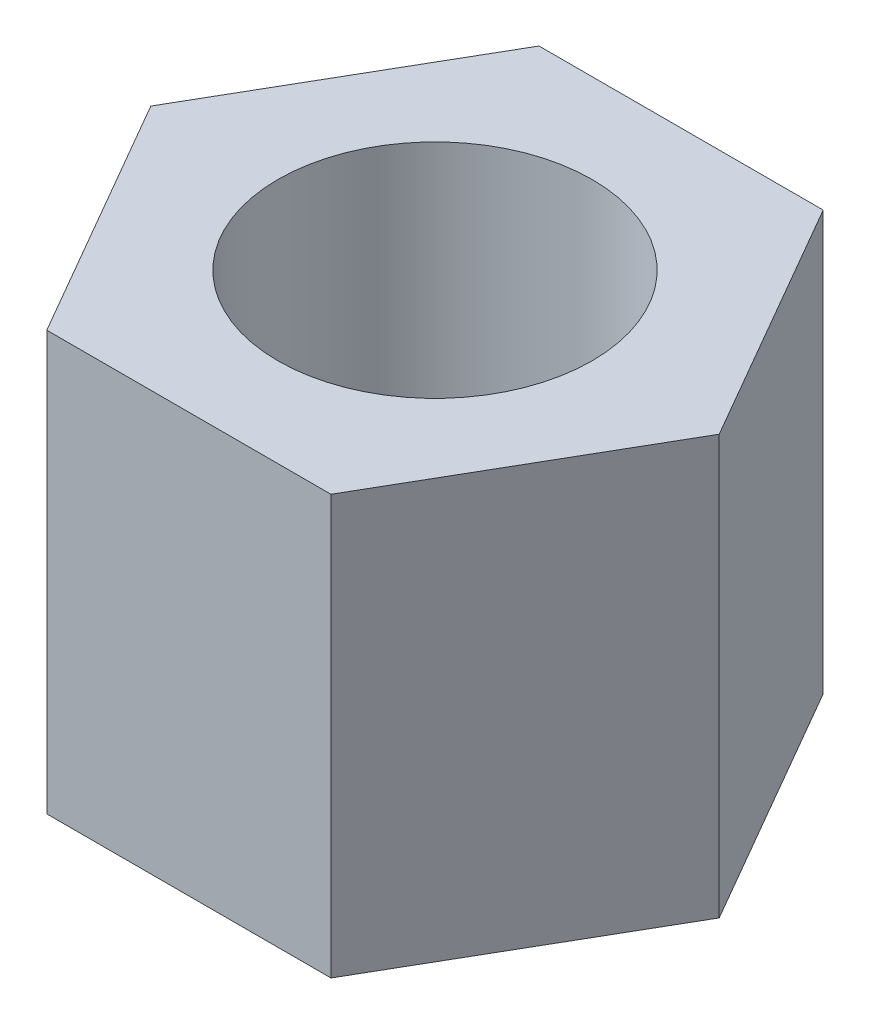
ISO-10303-21;
HEADER;
FILE_DESCRIPTION(('STEP AP214'),'2;1');
FILE_NAME('part.step','',(''),(''),'','','');
FILE_SCHEMA(('AUTOMOTIVE_DESIGN { 1 0 10303 214 1 1 1 1 }'));
ENDSEC;
DATA;
#1=APPLICATION_CONTEXT('core data for automotive mechanical design processes');
#2=APPLICATION_PROTOCOL_DEFINITION('international standard','automotive_design',2000,#1);
#3=PRODUCT_CONTEXT('',#1,'mechanical');
#4=PRODUCT('Part','Part','',(#3));
#5=PRODUCT_RELATED_PRODUCT_CATEGORY('part','',(#4));
#6=PRODUCT_DEFINITION_FORMATION('','',#4);
#7=PRODUCT_DEFINITION_CONTEXT('part definition',#1,'design');
#8=PRODUCT_DEFINITION('design','',#6,#7);
#9=PRODUCT_DEFINITION_SHAPE('','',#8);
#10=(LENGTH_UNIT() NAMED_UNIT(*) SI_UNIT(.MILLI.,.METRE.));
#11=(NAMED_UNIT(*) PLANE_ANGLE_UNIT() SI_UNIT($,.RADIAN.));
#12=(NAMED_UNIT(*) SI_UNIT($,.STERADIAN.) SOLID_ANGLE_UNIT());
#13=UNCERTAINTY_MEASURE_WITH_UNIT(LENGTH_MEASURE(1.E-05),#10,'distance_accuracy_value','');
#14=(GEOMETRIC_REPRESENTATION_CONTEXT(3) GLOBAL_UNCERTAINTY_ASSIGNED_CONTEXT((#13)) GLOBAL_UNIT_ASSIGNED_CONTEXT((#10,
#11,#12)) REPRESENTATION_CONTEXT('',''));
#15=CARTESIAN_POINT('',(0.,0.,0.));
#16=DIRECTION('',(0.,0.,1.));
#17=DIRECTION('',(1.,0.,0.));
#18=AXIS2_PLACEMENT_3D('',#15,#16,#17);
#19=CARTESIAN_POINT('',(0.,4.,0.));
#20=DIRECTION('',(0.,-1.,0.));
#21=DIRECTION('',(0.,0.,-1.));
#22=AXIS2_PLACEMENT_3D('',#19,#20,#21);
#23=PLANE('',#22);
#24=DIRECTION('',(-0.499999999999999,0.,0.866025403784439));
#25=VECTOR('',#24,1.);
#26=CARTESIAN_POINT('',(-2.71354626519124,4.,0.));
#27=LINE('',#26,#25);
#28=CARTESIAN_POINT('',(-1.35677313259562,4.,-2.35));
#29=VERTEX_POINT('',#28);
#30=CARTESIAN_POINT('',(-2.71354626519124,4.,0.));
#31=VERTEX_POINT('',#30);
#32=EDGE_CURVE('E146',#29,#31,#27,.T.);
#33=ORIENTED_EDGE('',*,*,#32,.T.);
#34=DIRECTION('',(0.500000000000003,0.,0.866025403784436));
#35=VECTOR('',#34,1.);
#36=CARTESIAN_POINT('',(-1.35677313259561,4.,2.35));
#37=LINE('',#36,#35);
#38=CARTESIAN_POINT('',(-1.35677313259561,4.,2.35));
#39=VERTEX_POINT('',#38);
#40=EDGE_CURVE('E94',#31,#39,#37,.T.);
#41=ORIENTED_EDGE('',*,*,#40,.T.);
#42=DIRECTION('',(1.,0.,0.));
#43=VECTOR('',#42,1.);
#44=CARTESIAN_POINT('',(1.35677313259563,4.,2.35));
#45=LINE('',#44,#43);
#46=CARTESIAN_POINT('',(1.35677313259563,4.,2.35));
#47=VERTEX_POINT('',#46);
#48=EDGE_CURVE('E107',#39,#47,#45,.T.);
#49=ORIENTED_EDGE('',*,*,#48,.T.);
#50=DIRECTION('',(0.500000000000002,0.,-0.866025403784438));
#51=VECTOR('',#50,1.);
#52=CARTESIAN_POINT('',(2.71354626519126,4.,0.));
#53=LINE('',#52,#51);
#54=CARTESIAN_POINT('',(2.71354626519126,4.,0.));
#55=VERTEX_POINT('',#54);
#56=EDGE_CURVE('E101',#47,#55,#53,.T.);
#57=ORIENTED_EDGE('',*,*,#56,.T.);
#58=DIRECTION('',(-0.500000000000003,0.,-0.866025403784437));
#59=VECTOR('',#58,1.);
#60=CARTESIAN_POINT('',(1.35677313259563,4.,-2.35000000000001));
#61=LINE('',#60,#59);
#62=CARTESIAN_POINT('',(1.35677313259563,4.,-2.35000000000001));
#63=VERTEX_POINT('',#62);
#64=EDGE_CURVE('E105',#55,#63,#61,.T.);
#65=ORIENTED_EDGE('',*,*,#64,.T.);
#66=DIRECTION('',(-1.,0.,0.));
#67=VECTOR('',#66,1.);
#68=CARTESIAN_POINT('',(-1.35677313259562,4.,-2.35));
#69=LINE('',#68,#67);
#70=EDGE_CURVE('E57',#63,#29,#69,.T.);
#71=ORIENTED_EDGE('',*,*,#70,.T.);
#72=EDGE_LOOP('',(#33,#41,#49,#57,#65,#71));
#73=FACE_BOUND('',#72,.T.);
#74=CARTESIAN_POINT('',(0.,4.,0.));
#75=DIRECTION('',(0.,1.,0.));
#76=DIRECTION('',(0.,0.,1.));
#77=AXIS2_PLACEMENT_3D('',#74,#75,#76);
#78=CIRCLE('',#77,1.5);
#79=CARTESIAN_POINT('',(0.,4.,1.5));
#80=VERTEX_POINT('',#79);
#81=EDGE_CURVE('E134',#80,#80,#78,.T.);
#82=ORIENTED_EDGE('',*,*,#81,.F.);
#83=EDGE_LOOP('',(#82));
#84=FACE_BOUND('',#83,.T.);
#85=ADVANCED_FACE('F39',(#73,#84),#23,.F.);
#86=CARTESIAN_POINT('',(0.,0.,0.));
#87=DIRECTION('',(0.,-1.,0.));
#88=DIRECTION('',(0.,0.,-1.));
#89=AXIS2_PLACEMENT_3D('',#86,#87,#88);
#90=PLANE('',#89);
#91=DIRECTION('',(-0.499999999999999,0.,0.866025403784439));
#92=VECTOR('',#91,1.);
#93=CARTESIAN_POINT('',(-2.71354626519124,0.,0.));
#94=LINE('',#93,#92);
#95=CARTESIAN_POINT('',(-1.35677313259562,0.,-2.35));
#96=VERTEX_POINT('',#95);
#97=CARTESIAN_POINT('',(-2.71354626519124,0.,0.));
#98=VERTEX_POINT('',#97);
#99=EDGE_CURVE('E129',#96,#98,#94,.T.);
#100=ORIENTED_EDGE('',*,*,#99,.F.);
#101=DIRECTION('',(-1.,0.,0.));
#102=VECTOR('',#101,1.);
#103=CARTESIAN_POINT('',(-1.35677313259562,0.,-2.35));
#104=LINE('',#103,#102);
#105=CARTESIAN_POINT('',(1.35677313259563,0.,-2.35000000000001));
#106=VERTEX_POINT('',#105);
#107=EDGE_CURVE('E86',#106,#96,#104,.T.);
#108=ORIENTED_EDGE('',*,*,#107,.F.);
#109=DIRECTION('',(-0.500000000000003,0.,-0.866025403784437));
#110=VECTOR('',#109,1.);
#111=CARTESIAN_POINT('',(1.35677313259563,0.,-2.35000000000001));
#112=LINE('',#111,#110);
#113=CARTESIAN_POINT('',(2.71354626519126,0.,0.));
#114=VERTEX_POINT('',#113);
#115=EDGE_CURVE('E80',#114,#106,#112,.T.);
#116=ORIENTED_EDGE('',*,*,#115,.F.);
#117=DIRECTION('',(0.500000000000002,0.,-0.866025403784438));
#118=VECTOR('',#117,1.);
#119=CARTESIAN_POINT('',(2.71354626519126,0.,0.));
#120=LINE('',#119,#118);
#121=CARTESIAN_POINT('',(1.35677313259563,0.,2.35));
#122=VERTEX_POINT('',#121);
#123=EDGE_CURVE('E116',#122,#114,#120,.T.);
#124=ORIENTED_EDGE('',*,*,#123,.F.);
#125=DIRECTION('',(1.,0.,0.));
#126=VECTOR('',#125,1.);
#127=CARTESIAN_POINT('',(1.35677313259563,0.,2.35));
#128=LINE('',#127,#126);
#129=CARTESIAN_POINT('',(-1.35677313259561,0.,2.35));
#130=VERTEX_POINT('',#129);
#131=EDGE_CURVE('E137',#130,#122,#128,.T.);
#132=ORIENTED_EDGE('',*,*,#131,.F.);
#133=DIRECTION('',(0.500000000000003,0.,0.866025403784436));
#134=VECTOR('',#133,1.);
#135=CARTESIAN_POINT('',(-1.35677313259561,0.,2.35));
#136=LINE('',#135,#134);
#137=EDGE_CURVE('E133',#98,#130,#136,.T.);
#138=ORIENTED_EDGE('',*,*,#137,.F.);
#139=EDGE_LOOP('',(#100,#108,#116,#124,#132,#138));
#140=FACE_BOUND('',#139,.T.);
#141=CARTESIAN_POINT('',(0.,0.,0.));
#142=DIRECTION('',(0.,1.,0.));
#143=DIRECTION('',(0.,0.,1.));
#144=AXIS2_PLACEMENT_3D('',#141,#142,#143);
#145=CIRCLE('',#144,1.5);
#146=CARTESIAN_POINT('',(0.,0.,1.5));
#147=VERTEX_POINT('',#146);
#148=EDGE_CURVE('E243',#147,#147,#145,.T.);
#149=ORIENTED_EDGE('',*,*,#148,.T.);
#150=EDGE_LOOP('',(#149));
#151=FACE_BOUND('',#150,.T.);
#152=ADVANCED_FACE('F159',(#140,#151),#90,.T.);
#153=CARTESIAN_POINT('',(-2.71354626519124,4.,0.));
#154=DIRECTION('',(0.866025403784439,0.,0.5));
#155=DIRECTION('',(0.5,0.,-0.866025403784439));
#156=AXIS2_PLACEMENT_3D('',#153,#154,#155);
#157=PLANE('',#156);
#158=ORIENTED_EDGE('',*,*,#99,.T.);
#159=DIRECTION('',(0.,-1.,0.));
#160=VECTOR('',#159,1.);
#161=CARTESIAN_POINT('',(-2.71354626519124,4.,0.));
#162=LINE('',#161,#160);
#163=EDGE_CURVE('E11',#31,#98,#162,.T.);
#164=ORIENTED_EDGE('',*,*,#163,.F.);
#165=ORIENTED_EDGE('',*,*,#32,.F.);
#166=DIRECTION('',(0.,-1.,0.));
#167=VECTOR('',#166,1.);
#168=CARTESIAN_POINT('',(-1.35677313259562,4.,-2.35));
#169=LINE('',#168,#167);
#170=EDGE_CURVE('E125',#29,#96,#169,.T.);
#171=ORIENTED_EDGE('',*,*,#170,.T.);
#172=EDGE_LOOP('',(#158,#164,#165,#171));
#173=FACE_BOUND('',#172,.T.);
#174=ADVANCED_FACE('F41',(#173),#157,.F.);
#175=CARTESIAN_POINT('',(-1.35677313259561,4.,2.35));
#176=DIRECTION('',(0.866025403784437,0.,-0.500000000000004));
#177=DIRECTION('',(-0.500000000000004,0.,-0.866025403784437));
#178=AXIS2_PLACEMENT_3D('',#175,#176,#177);
#179=PLANE('',#178);
#180=ORIENTED_EDGE('',*,*,#137,.T.);
#181=DIRECTION('',(0.,-1.,0.));
#182=VECTOR('',#181,1.);
#183=CARTESIAN_POINT('',(-1.35677313259561,4.,2.35));
#184=LINE('',#183,#182);
#185=EDGE_CURVE('E49',#39,#130,#184,.T.);
#186=ORIENTED_EDGE('',*,*,#185,.F.);
#187=ORIENTED_EDGE('',*,*,#40,.F.);
#188=ORIENTED_EDGE('',*,*,#163,.T.);
#189=EDGE_LOOP('',(#180,#186,#187,#188));
#190=FACE_BOUND('',#189,.T.);
#191=ADVANCED_FACE('F184',(#190),#179,.F.);
#192=CARTESIAN_POINT('',(1.35677313259563,4.,2.35));
#193=DIRECTION('',(0.,0.,-1.));
#194=DIRECTION('',(-1.,0.,0.));
#195=AXIS2_PLACEMENT_3D('',#192,#193,#194);
#196=PLANE('',#195);
#197=ORIENTED_EDGE('',*,*,#131,.T.);
#198=DIRECTION('',(0.,-1.,0.));
#199=VECTOR('',#198,1.);
#200=CARTESIAN_POINT('',(1.35677313259563,4.,2.35));
#201=LINE('',#200,#199);
#202=EDGE_CURVE('E118',#47,#122,#201,.T.);
#203=ORIENTED_EDGE('',*,*,#202,.F.);
#204=ORIENTED_EDGE('',*,*,#48,.F.);
#205=ORIENTED_EDGE('',*,*,#185,.T.);
#206=EDGE_LOOP('',(#197,#203,#204,#205));
#207=FACE_BOUND('',#206,.T.);
#208=ADVANCED_FACE('F156',(#207),#196,.F.);
#209=CARTESIAN_POINT('',(2.71354626519126,4.,0.));
#210=DIRECTION('',(-0.866025403784438,0.,-0.500000000000002));
#211=DIRECTION('',(-0.500000000000002,0.,0.866025403784438));
#212=AXIS2_PLACEMENT_3D('',#209,#210,#211);
#213=PLANE('',#212);
#214=ORIENTED_EDGE('',*,*,#123,.T.);
#215=DIRECTION('',(0.,-1.,0.));
#216=VECTOR('',#215,1.);
#217=CARTESIAN_POINT('',(2.71354626519126,4.,0.));
#218=LINE('',#217,#216);
#219=EDGE_CURVE('E113',#55,#114,#218,.T.);
#220=ORIENTED_EDGE('',*,*,#219,.F.);
#221=ORIENTED_EDGE('',*,*,#56,.F.);
#222=ORIENTED_EDGE('',*,*,#202,.T.);
#223=EDGE_LOOP('',(#214,#220,#221,#222));
#224=FACE_BOUND('',#223,.T.);
#225=ADVANCED_FACE('F114',(#224),#213,.F.);
#226=CARTESIAN_POINT('',(1.35677313259563,4.,-2.35000000000001));
#227=DIRECTION('',(-0.866025403784437,0.,0.500000000000003));
#228=DIRECTION('',(0.500000000000003,0.,0.866025403784437));
#229=AXIS2_PLACEMENT_3D('',#226,#227,#228);
#230=PLANE('',#229);
#231=ORIENTED_EDGE('',*,*,#115,.T.);
#232=DIRECTION('',(0.,-1.,0.));
#233=VECTOR('',#232,1.);
#234=CARTESIAN_POINT('',(1.35677313259563,4.,-2.35000000000001));
#235=LINE('',#234,#233);
#236=EDGE_CURVE('E119',#63,#106,#235,.T.);
#237=ORIENTED_EDGE('',*,*,#236,.F.);
#238=ORIENTED_EDGE('',*,*,#64,.F.);
#239=ORIENTED_EDGE('',*,*,#219,.T.);
#240=EDGE_LOOP('',(#231,#237,#238,#239));
#241=FACE_BOUND('',#240,.T.);
#242=ADVANCED_FACE('F121',(#241),#230,.F.);
#243=CARTESIAN_POINT('',(-1.35677313259562,4.,-2.35));
#244=DIRECTION('',(0.,0.,1.));
#245=DIRECTION('',(1.,0.,0.));
#246=AXIS2_PLACEMENT_3D('',#243,#244,#245);
#247=PLANE('',#246);
#248=ORIENTED_EDGE('',*,*,#107,.T.);
#249=ORIENTED_EDGE('',*,*,#170,.F.);
#250=ORIENTED_EDGE('',*,*,#70,.F.);
#251=ORIENTED_EDGE('',*,*,#236,.T.);
#252=EDGE_LOOP('',(#248,#249,#250,#251));
#253=FACE_BOUND('',#252,.T.);
#254=ADVANCED_FACE('F164',(#253),#247,.F.);
#255=CARTESIAN_POINT('',(0.,4.,0.));
#256=DIRECTION('',(0.,-1.,0.));
#257=DIRECTION('',(0.,0.,-1.));
#258=AXIS2_PLACEMENT_3D('',#255,#256,#257);
#259=CYLINDRICAL_SURFACE('',#258,1.5);
#260=ORIENTED_EDGE('',*,*,#81,.T.);
#261=EDGE_LOOP('',(#260));
#262=FACE_BOUND('',#261,.T.);
#263=ORIENTED_EDGE('',*,*,#148,.F.);
#264=EDGE_LOOP('',(#263));
#265=FACE_BOUND('',#264,.T.);
#266=ADVANCED_FACE('F166',(#262,#265),#259,.F.);
#267=CLOSED_SHELL('',(#85,#152,#174,#191,#208,#225,#242,#254,#266));
#268=MANIFOLD_SOLID_BREP('B2',#267);
#269=ADVANCED_BREP_SHAPE_REPRESENTATION('',(#18,#268),#14);
#270=SHAPE_DEFINITION_REPRESENTATION(#9,#269);
ENDSEC;
END-ISO-10303-21;
